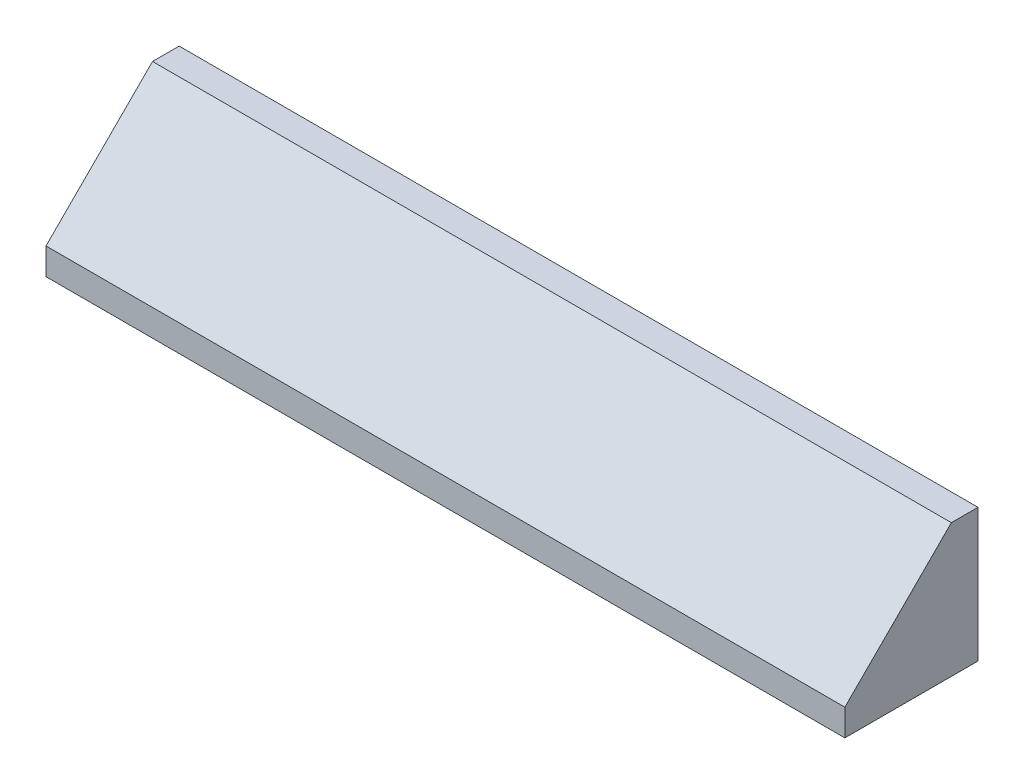
ISO-10303-21;
HEADER;
FILE_DESCRIPTION(('STEP AP214'),'2;1');
FILE_NAME('part.step','',(''),(''),'','','');
FILE_SCHEMA(('AUTOMOTIVE_DESIGN { 1 0 10303 214 1 1 1 1 }'));
ENDSEC;
DATA;
#1=APPLICATION_CONTEXT('core data for automotive mechanical design processes');
#2=APPLICATION_PROTOCOL_DEFINITION('international standard','automotive_design',2000,#1);
#3=PRODUCT_CONTEXT('',#1,'mechanical');
#4=PRODUCT('Part','Part','',(#3));
#5=PRODUCT_RELATED_PRODUCT_CATEGORY('part','',(#4));
#6=PRODUCT_DEFINITION_FORMATION('','',#4);
#7=PRODUCT_DEFINITION_CONTEXT('part definition',#1,'design');
#8=PRODUCT_DEFINITION('design','',#6,#7);
#9=PRODUCT_DEFINITION_SHAPE('','',#8);
#10=(LENGTH_UNIT() NAMED_UNIT(*) SI_UNIT(.MILLI.,.METRE.));
#11=(NAMED_UNIT(*) PLANE_ANGLE_UNIT() SI_UNIT($,.RADIAN.));
#12=(NAMED_UNIT(*) SI_UNIT($,.STERADIAN.) SOLID_ANGLE_UNIT());
#13=UNCERTAINTY_MEASURE_WITH_UNIT(LENGTH_MEASURE(1.E-05),#10,'distance_accuracy_value','');
#14=(GEOMETRIC_REPRESENTATION_CONTEXT(3) GLOBAL_UNCERTAINTY_ASSIGNED_CONTEXT((#13)) GLOBAL_UNIT_ASSIGNED_CONTEXT((#10,
#11,#12)) REPRESENTATION_CONTEXT('',''));
#15=CARTESIAN_POINT('',(0.,0.,0.));
#16=DIRECTION('',(0.,0.,1.));
#17=DIRECTION('',(1.,0.,0.));
#18=AXIS2_PLACEMENT_3D('',#15,#16,#17);
#19=CARTESIAN_POINT('',(300.,0.,50.0000000000004));
#20=DIRECTION('',(0.,1.,0.));
#21=DIRECTION('',(0.,0.,1.));
#22=AXIS2_PLACEMENT_3D('',#19,#20,#21);
#23=PLANE('',#22);
#24=DIRECTION('',(0.,0.,-1.));
#25=VECTOR('',#24,1.);
#26=CARTESIAN_POINT('',(0.,0.,50.0000000000004));
#27=LINE('',#26,#25);
#28=CARTESIAN_POINT('',(0.,0.,50.0000000000004));
#29=VERTEX_POINT('',#28);
#30=CARTESIAN_POINT('',(0.,0.,0.));
#31=VERTEX_POINT('',#30);
#32=EDGE_CURVE('E106',#29,#31,#27,.T.);
#33=ORIENTED_EDGE('',*,*,#32,.T.);
#34=DIRECTION('',(-1.,0.,0.));
#35=VECTOR('',#34,1.);
#36=CARTESIAN_POINT('',(300.,0.,0.));
#37=LINE('',#36,#35);
#38=CARTESIAN_POINT('',(300.,0.,0.));
#39=VERTEX_POINT('',#38);
#40=EDGE_CURVE('E11',#39,#31,#37,.T.);
#41=ORIENTED_EDGE('',*,*,#40,.F.);
#42=DIRECTION('',(0.,0.,-1.));
#43=VECTOR('',#42,1.);
#44=CARTESIAN_POINT('',(300.,0.,50.0000000000004));
#45=LINE('',#44,#43);
#46=CARTESIAN_POINT('',(300.,0.,50.0000000000004));
#47=VERTEX_POINT('',#46);
#48=EDGE_CURVE('E114',#47,#39,#45,.T.);
#49=ORIENTED_EDGE('',*,*,#48,.F.);
#50=DIRECTION('',(-1.,0.,0.));
#51=VECTOR('',#50,1.);
#52=CARTESIAN_POINT('',(300.,0.,50.0000000000004));
#53=LINE('',#52,#51);
#54=EDGE_CURVE('E102',#47,#29,#53,.T.);
#55=ORIENTED_EDGE('',*,*,#54,.T.);
#56=EDGE_LOOP('',(#33,#41,#49,#55));
#57=FACE_BOUND('',#56,.T.);
#58=ADVANCED_FACE('F32',(#57),#23,.F.);
#59=CARTESIAN_POINT('',(300.,0.,0.));
#60=DIRECTION('',(0.,0.,1.));
#61=DIRECTION('',(1.,0.,0.));
#62=AXIS2_PLACEMENT_3D('',#59,#60,#61);
#63=PLANE('',#62);
#64=DIRECTION('',(0.,1.,0.));
#65=VECTOR('',#64,1.);
#66=CARTESIAN_POINT('',(0.,0.,0.));
#67=LINE('',#66,#65);
#68=CARTESIAN_POINT('',(0.,50.,0.));
#69=VERTEX_POINT('',#68);
#70=EDGE_CURVE('E109',#31,#69,#67,.T.);
#71=ORIENTED_EDGE('',*,*,#70,.T.);
#72=DIRECTION('',(-1.,0.,0.));
#73=VECTOR('',#72,1.);
#74=CARTESIAN_POINT('',(300.,50.,0.));
#75=LINE('',#74,#73);
#76=CARTESIAN_POINT('',(300.,50.,0.));
#77=VERTEX_POINT('',#76);
#78=EDGE_CURVE('E40',#77,#69,#75,.T.);
#79=ORIENTED_EDGE('',*,*,#78,.F.);
#80=DIRECTION('',(0.,1.,0.));
#81=VECTOR('',#80,1.);
#82=CARTESIAN_POINT('',(300.,0.,0.));
#83=LINE('',#82,#81);
#84=EDGE_CURVE('E82',#39,#77,#83,.T.);
#85=ORIENTED_EDGE('',*,*,#84,.F.);
#86=ORIENTED_EDGE('',*,*,#40,.T.);
#87=EDGE_LOOP('',(#71,#79,#85,#86));
#88=FACE_BOUND('',#87,.T.);
#89=ADVANCED_FACE('F133',(#88),#63,.F.);
#90=CARTESIAN_POINT('',(300.,50.,0.));
#91=DIRECTION('',(0.,-1.,0.));
#92=DIRECTION('',(0.,0.,-1.));
#93=AXIS2_PLACEMENT_3D('',#90,#91,#92);
#94=PLANE('',#93);
#95=DIRECTION('',(0.,0.,1.));
#96=VECTOR('',#95,1.);
#97=CARTESIAN_POINT('',(0.,50.,0.));
#98=LINE('',#97,#96);
#99=CARTESIAN_POINT('',(0.,50.,10.));
#100=VERTEX_POINT('',#99);
#101=EDGE_CURVE('E97',#69,#100,#98,.T.);
#102=ORIENTED_EDGE('',*,*,#101,.T.);
#103=DIRECTION('',(-1.,0.,0.));
#104=VECTOR('',#103,1.);
#105=CARTESIAN_POINT('',(300.,50.,10.));
#106=LINE('',#105,#104);
#107=CARTESIAN_POINT('',(300.,50.,10.));
#108=VERTEX_POINT('',#107);
#109=EDGE_CURVE('E94',#108,#100,#106,.T.);
#110=ORIENTED_EDGE('',*,*,#109,.F.);
#111=DIRECTION('',(0.,0.,1.));
#112=VECTOR('',#111,1.);
#113=CARTESIAN_POINT('',(300.,50.,0.));
#114=LINE('',#113,#112);
#115=EDGE_CURVE('E86',#77,#108,#114,.T.);
#116=ORIENTED_EDGE('',*,*,#115,.F.);
#117=ORIENTED_EDGE('',*,*,#78,.T.);
#118=EDGE_LOOP('',(#102,#110,#116,#117));
#119=FACE_BOUND('',#118,.T.);
#120=ADVANCED_FACE('F95',(#119),#94,.F.);
#121=CARTESIAN_POINT('',(300.,50.,10.));
#122=DIRECTION('',(0.,-0.707106781186551,-0.707106781186544));
#123=DIRECTION('',(0.,0.707106781186544,-0.707106781186551));
#124=AXIS2_PLACEMENT_3D('',#121,#122,#123);
#125=PLANE('',#124);
#126=DIRECTION('',(0.,-0.707106781186544,0.707106781186551));
#127=VECTOR('',#126,1.);
#128=CARTESIAN_POINT('',(0.,50.,10.));
#129=LINE('',#128,#127);
#130=CARTESIAN_POINT('',(0.,10.,50.0000000000004));
#131=VERTEX_POINT('',#130);
#132=EDGE_CURVE('E68',#100,#131,#129,.T.);
#133=ORIENTED_EDGE('',*,*,#132,.T.);
#134=DIRECTION('',(-1.,0.,0.));
#135=VECTOR('',#134,1.);
#136=CARTESIAN_POINT('',(300.,10.,50.0000000000004));
#137=LINE('',#136,#135);
#138=CARTESIAN_POINT('',(300.,10.,50.0000000000004));
#139=VERTEX_POINT('',#138);
#140=EDGE_CURVE('E98',#139,#131,#137,.T.);
#141=ORIENTED_EDGE('',*,*,#140,.F.);
#142=DIRECTION('',(0.,-0.707106781186544,0.707106781186551));
#143=VECTOR('',#142,1.);
#144=CARTESIAN_POINT('',(300.,50.,10.));
#145=LINE('',#144,#143);
#146=EDGE_CURVE('E90',#108,#139,#145,.T.);
#147=ORIENTED_EDGE('',*,*,#146,.F.);
#148=ORIENTED_EDGE('',*,*,#109,.T.);
#149=EDGE_LOOP('',(#133,#141,#147,#148));
#150=FACE_BOUND('',#149,.T.);
#151=ADVANCED_FACE('F100',(#150),#125,.F.);
#152=CARTESIAN_POINT('',(300.,10.,50.0000000000004));
#153=DIRECTION('',(0.,0.,-1.));
#154=DIRECTION('',(-1.,0.,0.));
#155=AXIS2_PLACEMENT_3D('',#152,#153,#154);
#156=PLANE('',#155);
#157=DIRECTION('',(0.,-1.,0.));
#158=VECTOR('',#157,1.);
#159=CARTESIAN_POINT('',(0.,10.,50.0000000000004));
#160=LINE('',#159,#158);
#161=EDGE_CURVE('E74',#131,#29,#160,.T.);
#162=ORIENTED_EDGE('',*,*,#161,.T.);
#163=ORIENTED_EDGE('',*,*,#54,.F.);
#164=DIRECTION('',(0.,-1.,0.));
#165=VECTOR('',#164,1.);
#166=CARTESIAN_POINT('',(300.,10.,50.0000000000004));
#167=LINE('',#166,#165);
#168=EDGE_CURVE('E48',#139,#47,#167,.T.);
#169=ORIENTED_EDGE('',*,*,#168,.F.);
#170=ORIENTED_EDGE('',*,*,#140,.T.);
#171=EDGE_LOOP('',(#162,#163,#169,#170));
#172=FACE_BOUND('',#171,.T.);
#173=ADVANCED_FACE('F122',(#172),#156,.F.);
#174=CARTESIAN_POINT('',(300.,0.,0.));
#175=DIRECTION('',(1.,0.,0.));
#176=DIRECTION('',(0.,0.,-1.));
#177=AXIS2_PLACEMENT_3D('',#174,#175,#176);
#178=PLANE('',#177);
#179=ORIENTED_EDGE('',*,*,#48,.T.);
#180=ORIENTED_EDGE('',*,*,#84,.T.);
#181=ORIENTED_EDGE('',*,*,#115,.T.);
#182=ORIENTED_EDGE('',*,*,#146,.T.);
#183=ORIENTED_EDGE('',*,*,#168,.T.);
#184=EDGE_LOOP('',(#179,#180,#181,#182,#183));
#185=FACE_BOUND('',#184,.T.);
#186=ADVANCED_FACE('F88',(#185),#178,.T.);
#187=CARTESIAN_POINT('',(0.,0.,0.));
#188=DIRECTION('',(1.,0.,0.));
#189=DIRECTION('',(0.,0.,-1.));
#190=AXIS2_PLACEMENT_3D('',#187,#188,#189);
#191=PLANE('',#190);
#192=ORIENTED_EDGE('',*,*,#32,.F.);
#193=ORIENTED_EDGE('',*,*,#161,.F.);
#194=ORIENTED_EDGE('',*,*,#132,.F.);
#195=ORIENTED_EDGE('',*,*,#101,.F.);
#196=ORIENTED_EDGE('',*,*,#70,.F.);
#197=EDGE_LOOP('',(#192,#193,#194,#195,#196));
#198=FACE_BOUND('',#197,.T.);
#199=ADVANCED_FACE('F118',(#198),#191,.F.);
#200=CLOSED_SHELL('',(#58,#89,#120,#151,#173,#186,#199));
#201=MANIFOLD_SOLID_BREP('B2',#200);
#202=ADVANCED_BREP_SHAPE_REPRESENTATION('',(#18,#201),#14);
#203=SHAPE_DEFINITION_REPRESENTATION(#9,#202);
ENDSEC;
END-ISO-10303-21;
